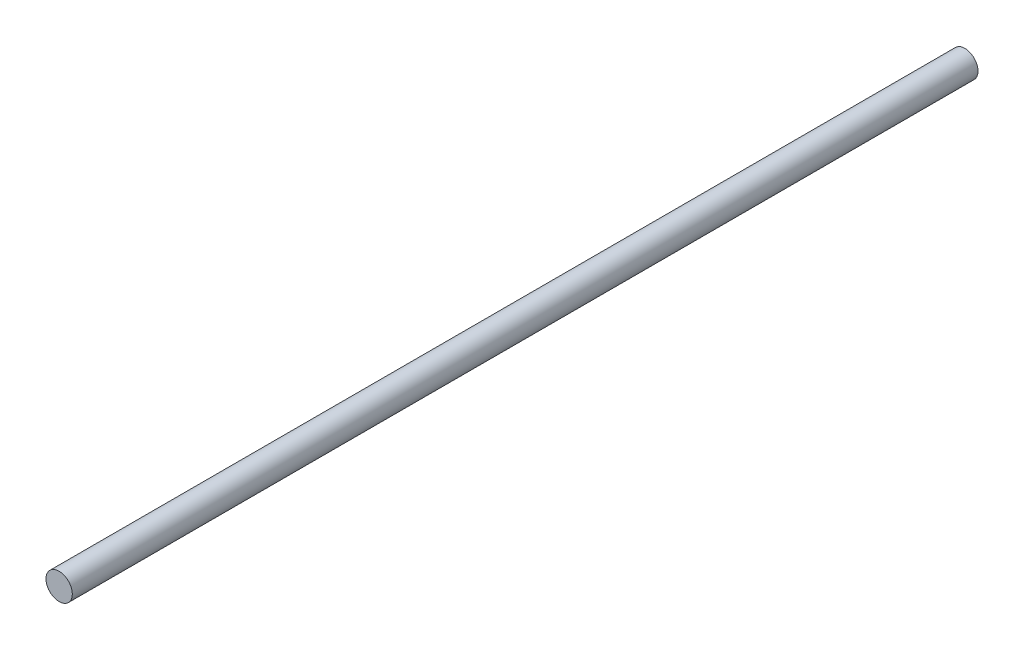
ISO-10303-21;
HEADER;
FILE_DESCRIPTION(('STEP AP214'),'2;1');
FILE_NAME('part.step','',(''),(''),'','','');
FILE_SCHEMA(('AUTOMOTIVE_DESIGN { 1 0 10303 214 1 1 1 1 }'));
ENDSEC;
DATA;
#1=APPLICATION_CONTEXT('core data for automotive mechanical design processes');
#2=APPLICATION_PROTOCOL_DEFINITION('international standard','automotive_design',2000,#1);
#3=PRODUCT_CONTEXT('',#1,'mechanical');
#4=PRODUCT('Part','Part','',(#3));
#5=PRODUCT_RELATED_PRODUCT_CATEGORY('part','',(#4));
#6=PRODUCT_DEFINITION_FORMATION('','',#4);
#7=PRODUCT_DEFINITION_CONTEXT('part definition',#1,'design');
#8=PRODUCT_DEFINITION('design','',#6,#7);
#9=PRODUCT_DEFINITION_SHAPE('','',#8);
#10=(LENGTH_UNIT() NAMED_UNIT(*) SI_UNIT(.MILLI.,.METRE.));
#11=(NAMED_UNIT(*) PLANE_ANGLE_UNIT() SI_UNIT($,.RADIAN.));
#12=(NAMED_UNIT(*) SI_UNIT($,.STERADIAN.) SOLID_ANGLE_UNIT());
#13=UNCERTAINTY_MEASURE_WITH_UNIT(LENGTH_MEASURE(1.E-05),#10,'distance_accuracy_value','');
#14=(GEOMETRIC_REPRESENTATION_CONTEXT(3) GLOBAL_UNCERTAINTY_ASSIGNED_CONTEXT((#13)) GLOBAL_UNIT_ASSIGNED_CONTEXT((#10,
#11,#12)) REPRESENTATION_CONTEXT('',''));
#15=CARTESIAN_POINT('',(0.,0.,0.));
#16=DIRECTION('',(0.,0.,1.));
#17=DIRECTION('',(1.,0.,0.));
#18=AXIS2_PLACEMENT_3D('',#15,#16,#17);
#19=CARTESIAN_POINT('',(0.,0.,344.));
#20=DIRECTION('',(0.,0.,-1.));
#21=DIRECTION('',(-1.,0.,0.));
#22=AXIS2_PLACEMENT_3D('',#19,#20,#21);
#23=CYLINDRICAL_SURFACE('',#22,5.);
#24=CARTESIAN_POINT('',(0.,0.,344.));
#25=DIRECTION('',(0.,0.,1.));
#26=DIRECTION('',(1.,0.,0.));
#27=AXIS2_PLACEMENT_3D('',#24,#25,#26);
#28=CIRCLE('',#27,5.);
#29=CARTESIAN_POINT('',(5.,0.,344.));
#30=VERTEX_POINT('',#29);
#31=EDGE_CURVE('E10',#30,#30,#28,.T.);
#32=ORIENTED_EDGE('',*,*,#31,.F.);
#33=EDGE_LOOP('',(#32));
#34=FACE_BOUND('',#33,.T.);
#35=CARTESIAN_POINT('',(0.,0.,0.));
#36=DIRECTION('',(0.,0.,1.));
#37=DIRECTION('',(1.,0.,0.));
#38=AXIS2_PLACEMENT_3D('',#35,#36,#37);
#39=CIRCLE('',#38,5.);
#40=CARTESIAN_POINT('',(5.,0.,0.));
#41=VERTEX_POINT('',#40);
#42=EDGE_CURVE('E41',#41,#41,#39,.T.);
#43=ORIENTED_EDGE('',*,*,#42,.T.);
#44=EDGE_LOOP('',(#43));
#45=FACE_BOUND('',#44,.T.);
#46=ADVANCED_FACE('F38',(#34,#45),#23,.T.);
#47=CARTESIAN_POINT('',(0.,0.,344.));
#48=DIRECTION('',(0.,0.,1.));
#49=DIRECTION('',(1.,0.,0.));
#50=AXIS2_PLACEMENT_3D('',#47,#48,#49);
#51=PLANE('',#50);
#52=ORIENTED_EDGE('',*,*,#31,.T.);
#53=EDGE_LOOP('',(#52));
#54=FACE_BOUND('',#53,.T.);
#55=ADVANCED_FACE('F55',(#54),#51,.T.);
#56=CARTESIAN_POINT('',(0.,0.,0.));
#57=DIRECTION('',(0.,0.,1.));
#58=DIRECTION('',(1.,0.,0.));
#59=AXIS2_PLACEMENT_3D('',#56,#57,#58);
#60=PLANE('',#59);
#61=ORIENTED_EDGE('',*,*,#42,.F.);
#62=EDGE_LOOP('',(#61));
#63=FACE_BOUND('',#62,.T.);
#64=ADVANCED_FACE('F53',(#63),#60,.F.);
#65=CLOSED_SHELL('',(#46,#55,#64));
#66=MANIFOLD_SOLID_BREP('B2',#65);
#67=ADVANCED_BREP_SHAPE_REPRESENTATION('',(#18,#66),#14);
#68=SHAPE_DEFINITION_REPRESENTATION(#9,#67);
ENDSEC;
END-ISO-10303-21;
